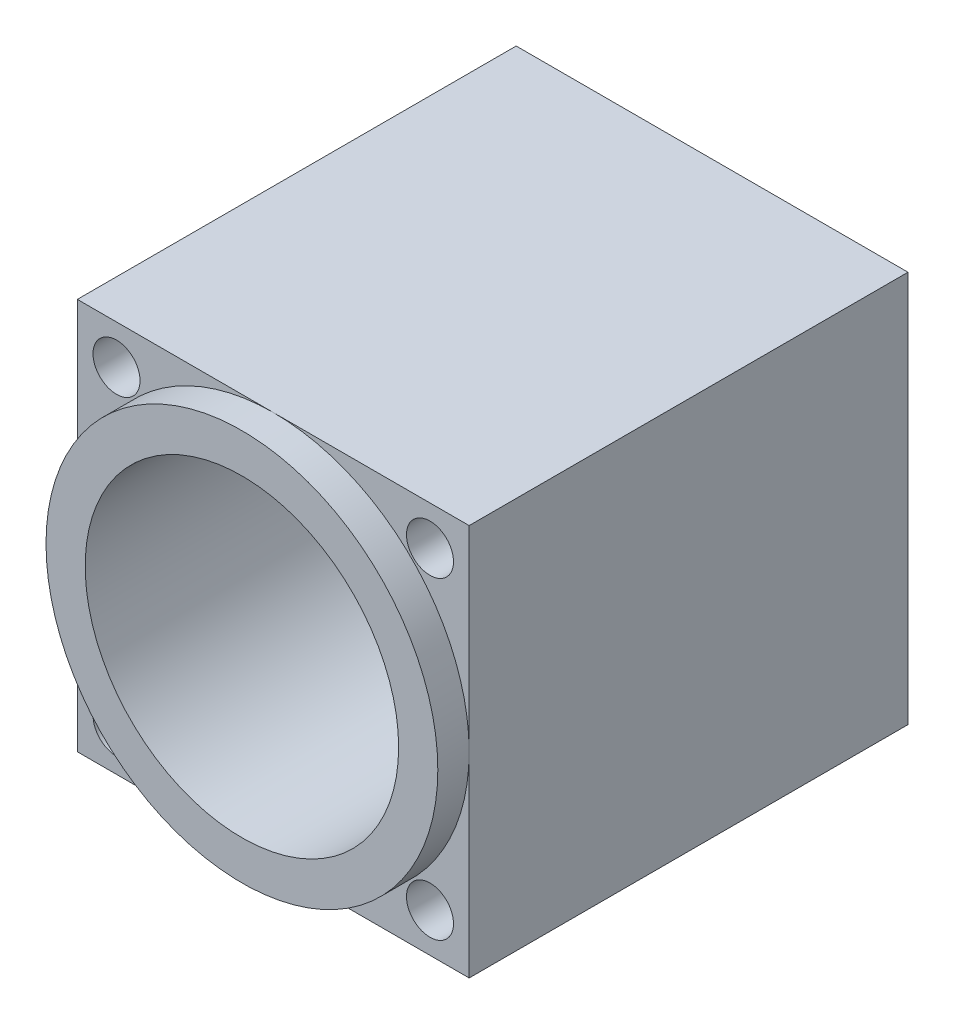
ISO-10303-21;
HEADER;
FILE_DESCRIPTION(('STEP AP214'),'2;1');
FILE_NAME('part.step','',(''),(''),'','','');
FILE_SCHEMA(('AUTOMOTIVE_DESIGN { 1 0 10303 214 1 1 1 1 }'));
ENDSEC;
DATA;
#1=APPLICATION_CONTEXT('core data for automotive mechanical design processes');
#2=APPLICATION_PROTOCOL_DEFINITION('international standard','automotive_design',2000,#1);
#3=PRODUCT_CONTEXT('',#1,'mechanical');
#4=PRODUCT('Part','Part','',(#3));
#5=PRODUCT_RELATED_PRODUCT_CATEGORY('part','',(#4));
#6=PRODUCT_DEFINITION_FORMATION('','',#4);
#7=PRODUCT_DEFINITION_CONTEXT('part definition',#1,'design');
#8=PRODUCT_DEFINITION('design','',#6,#7);
#9=PRODUCT_DEFINITION_SHAPE('','',#8);
#10=(LENGTH_UNIT() NAMED_UNIT(*) SI_UNIT(.MILLI.,.METRE.));
#11=(NAMED_UNIT(*) PLANE_ANGLE_UNIT() SI_UNIT($,.RADIAN.));
#12=(NAMED_UNIT(*) SI_UNIT($,.STERADIAN.) SOLID_ANGLE_UNIT());
#13=UNCERTAINTY_MEASURE_WITH_UNIT(LENGTH_MEASURE(1.E-05),#10,'distance_accuracy_value','');
#14=(GEOMETRIC_REPRESENTATION_CONTEXT(3) GLOBAL_UNCERTAINTY_ASSIGNED_CONTEXT((#13)) GLOBAL_UNIT_ASSIGNED_CONTEXT((#10,
#11,#12)) REPRESENTATION_CONTEXT('',''));
#15=CARTESIAN_POINT('',(0.,0.,0.));
#16=DIRECTION('',(0.,0.,1.));
#17=DIRECTION('',(1.,0.,0.));
#18=AXIS2_PLACEMENT_3D('',#15,#16,#17);
#19=CARTESIAN_POINT('',(-12.5,12.5,30.));
#20=DIRECTION('',(0.,0.,-1.));
#21=DIRECTION('',(-1.,0.,0.));
#22=AXIS2_PLACEMENT_3D('',#19,#20,#21);
#23=PLANE('',#22);
#24=CARTESIAN_POINT('',(0.,0.,30.));
#25=DIRECTION('',(0.,0.,1.));
#26=DIRECTION('',(1.,0.,0.));
#27=AXIS2_PLACEMENT_3D('',#24,#25,#26);
#28=CIRCLE('',#27,10.);
#29=CARTESIAN_POINT('',(10.,0.,30.));
#30=VERTEX_POINT('',#29);
#31=EDGE_CURVE('E129',#30,#30,#28,.T.);
#32=ORIENTED_EDGE('',*,*,#31,.F.);
#33=EDGE_LOOP('',(#32));
#34=FACE_BOUND('',#33,.T.);
#35=CARTESIAN_POINT('',(0.,0.,30.));
#36=DIRECTION('',(0.,0.,1.));
#37=DIRECTION('',(1.,0.,0.));
#38=AXIS2_PLACEMENT_3D('',#35,#36,#37);
#39=CIRCLE('',#38,12.5);
#40=CARTESIAN_POINT('',(12.5,0.,30.));
#41=VERTEX_POINT('',#40);
#42=EDGE_CURVE('E103',#41,#41,#39,.T.);
#43=ORIENTED_EDGE('',*,*,#42,.T.);
#44=EDGE_LOOP('',(#43));
#45=FACE_BOUND('',#44,.T.);
#46=ADVANCED_FACE('F31',(#34,#45),#23,.F.);
#47=CARTESIAN_POINT('',(-12.5,-12.5,30.));
#48=DIRECTION('',(1.,0.,0.));
#49=DIRECTION('',(0.,0.,-1.));
#50=AXIS2_PLACEMENT_3D('',#47,#48,#49);
#51=PLANE('',#50);
#52=DIRECTION('',(0.,-1.,0.));
#53=VECTOR('',#52,1.);
#54=CARTESIAN_POINT('',(-12.5,-12.5,28.));
#55=LINE('',#54,#53);
#56=CARTESIAN_POINT('',(-12.5,12.5,28.));
#57=VERTEX_POINT('',#56);
#58=CARTESIAN_POINT('',(-12.5,0.,28.));
#59=VERTEX_POINT('',#58);
#60=EDGE_CURVE('E124',#57,#59,#55,.T.);
#61=ORIENTED_EDGE('',*,*,#60,.F.);
#62=DIRECTION('',(0.,0.,-1.));
#63=VECTOR('',#62,1.);
#64=CARTESIAN_POINT('',(-12.5,12.5,30.));
#65=LINE('',#64,#63);
#66=CARTESIAN_POINT('',(-12.5,12.5,0.));
#67=VERTEX_POINT('',#66);
#68=EDGE_CURVE('E56',#57,#67,#65,.T.);
#69=ORIENTED_EDGE('',*,*,#68,.T.);
#70=DIRECTION('',(0.,-1.,0.));
#71=VECTOR('',#70,1.);
#72=CARTESIAN_POINT('',(-12.5,-12.5,0.));
#73=LINE('',#72,#71);
#74=CARTESIAN_POINT('',(-12.5,-12.5,0.));
#75=VERTEX_POINT('',#74);
#76=EDGE_CURVE('E147',#67,#75,#73,.T.);
#77=ORIENTED_EDGE('',*,*,#76,.T.);
#78=DIRECTION('',(0.,0.,-1.));
#79=VECTOR('',#78,1.);
#80=CARTESIAN_POINT('',(-12.5,-12.5,30.));
#81=LINE('',#80,#79);
#82=CARTESIAN_POINT('',(-12.5,-12.5,28.));
#83=VERTEX_POINT('',#82);
#84=EDGE_CURVE('E11',#83,#75,#81,.T.);
#85=ORIENTED_EDGE('',*,*,#84,.F.);
#86=EDGE_CURVE('E122',#59,#83,#55,.T.);
#87=ORIENTED_EDGE('',*,*,#86,.F.);
#88=EDGE_LOOP('',(#61,#69,#77,#85,#87));
#89=FACE_BOUND('',#88,.T.);
#90=ADVANCED_FACE('F33',(#89),#51,.F.);
#91=CARTESIAN_POINT('',(-12.5,-12.5,30.));
#92=DIRECTION('',(0.,1.,0.));
#93=DIRECTION('',(0.,0.,1.));
#94=AXIS2_PLACEMENT_3D('',#91,#92,#93);
#95=PLANE('',#94);
#96=DIRECTION('',(1.,0.,0.));
#97=VECTOR('',#96,1.);
#98=CARTESIAN_POINT('',(-12.5,-12.5,28.));
#99=LINE('',#98,#97);
#100=CARTESIAN_POINT('',(0.,-12.5,28.));
#101=VERTEX_POINT('',#100);
#102=EDGE_CURVE('E121',#83,#101,#99,.T.);
#103=ORIENTED_EDGE('',*,*,#102,.F.);
#104=ORIENTED_EDGE('',*,*,#84,.T.);
#105=DIRECTION('',(1.,0.,0.));
#106=VECTOR('',#105,1.);
#107=CARTESIAN_POINT('',(-12.5,-12.5,0.));
#108=LINE('',#107,#106);
#109=CARTESIAN_POINT('',(12.5,-12.5,0.));
#110=VERTEX_POINT('',#109);
#111=EDGE_CURVE('E149',#75,#110,#108,.T.);
#112=ORIENTED_EDGE('',*,*,#111,.T.);
#113=DIRECTION('',(0.,0.,-1.));
#114=VECTOR('',#113,1.);
#115=CARTESIAN_POINT('',(12.5,-12.5,30.));
#116=LINE('',#115,#114);
#117=CARTESIAN_POINT('',(12.5,-12.5,28.));
#118=VERTEX_POINT('',#117);
#119=EDGE_CURVE('E40',#118,#110,#116,.T.);
#120=ORIENTED_EDGE('',*,*,#119,.F.);
#121=EDGE_CURVE('E94',#101,#118,#99,.T.);
#122=ORIENTED_EDGE('',*,*,#121,.F.);
#123=EDGE_LOOP('',(#103,#104,#112,#120,#122));
#124=FACE_BOUND('',#123,.T.);
#125=ADVANCED_FACE('F207',(#124),#95,.F.);
#126=CARTESIAN_POINT('',(12.5,-12.5,30.));
#127=DIRECTION('',(-1.,0.,0.));
#128=DIRECTION('',(0.,0.,1.));
#129=AXIS2_PLACEMENT_3D('',#126,#127,#128);
#130=PLANE('',#129);
#131=DIRECTION('',(0.,1.,0.));
#132=VECTOR('',#131,1.);
#133=CARTESIAN_POINT('',(12.5,-12.5,28.));
#134=LINE('',#133,#132);
#135=CARTESIAN_POINT('',(12.5,0.,28.));
#136=VERTEX_POINT('',#135);
#137=EDGE_CURVE('E89',#118,#136,#134,.T.);
#138=ORIENTED_EDGE('',*,*,#137,.F.);
#139=ORIENTED_EDGE('',*,*,#119,.T.);
#140=DIRECTION('',(0.,1.,0.));
#141=VECTOR('',#140,1.);
#142=CARTESIAN_POINT('',(12.5,-12.5,0.));
#143=LINE('',#142,#141);
#144=CARTESIAN_POINT('',(12.5,12.5,0.));
#145=VERTEX_POINT('',#144);
#146=EDGE_CURVE('E152',#110,#145,#143,.T.);
#147=ORIENTED_EDGE('',*,*,#146,.T.);
#148=DIRECTION('',(0.,0.,-1.));
#149=VECTOR('',#148,1.);
#150=CARTESIAN_POINT('',(12.5,12.5,30.));
#151=LINE('',#150,#149);
#152=CARTESIAN_POINT('',(12.5,12.5,28.));
#153=VERTEX_POINT('',#152);
#154=EDGE_CURVE('E115',#153,#145,#151,.T.);
#155=ORIENTED_EDGE('',*,*,#154,.F.);
#156=EDGE_CURVE('E98',#136,#153,#134,.T.);
#157=ORIENTED_EDGE('',*,*,#156,.F.);
#158=EDGE_LOOP('',(#138,#139,#147,#155,#157));
#159=FACE_BOUND('',#158,.T.);
#160=ADVANCED_FACE('F113',(#159),#130,.F.);
#161=CARTESIAN_POINT('',(-12.5,12.5,30.));
#162=DIRECTION('',(0.,-1.,0.));
#163=DIRECTION('',(0.,0.,-1.));
#164=AXIS2_PLACEMENT_3D('',#161,#162,#163);
#165=PLANE('',#164);
#166=DIRECTION('',(-1.,0.,0.));
#167=VECTOR('',#166,1.);
#168=CARTESIAN_POINT('',(-12.5,12.5,28.));
#169=LINE('',#168,#167);
#170=CARTESIAN_POINT('',(0.,12.5,28.));
#171=VERTEX_POINT('',#170);
#172=EDGE_CURVE('E109',#153,#171,#169,.T.);
#173=ORIENTED_EDGE('',*,*,#172,.F.);
#174=ORIENTED_EDGE('',*,*,#154,.T.);
#175=DIRECTION('',(-1.,0.,0.));
#176=VECTOR('',#175,1.);
#177=CARTESIAN_POINT('',(-12.5,12.5,0.));
#178=LINE('',#177,#176);
#179=EDGE_CURVE('E154',#145,#67,#178,.T.);
#180=ORIENTED_EDGE('',*,*,#179,.T.);
#181=ORIENTED_EDGE('',*,*,#68,.F.);
#182=EDGE_CURVE('E116',#171,#57,#169,.T.);
#183=ORIENTED_EDGE('',*,*,#182,.F.);
#184=EDGE_LOOP('',(#173,#174,#180,#181,#183));
#185=FACE_BOUND('',#184,.T.);
#186=ADVANCED_FACE('F198',(#185),#165,.F.);
#187=CARTESIAN_POINT('',(10.,10.,30.));
#188=DIRECTION('',(0.,0.,-1.));
#189=DIRECTION('',(-1.,0.,0.));
#190=AXIS2_PLACEMENT_3D('',#187,#188,#189);
#191=CYLINDRICAL_SURFACE('',#190,1.5);
#192=CARTESIAN_POINT('',(10.,10.,0.));
#193=DIRECTION('',(0.,0.,1.));
#194=DIRECTION('',(1.,0.,0.));
#195=AXIS2_PLACEMENT_3D('',#192,#193,#194);
#196=CIRCLE('',#195,1.5);
#197=CARTESIAN_POINT('',(11.5,10.,0.));
#198=VERTEX_POINT('',#197);
#199=EDGE_CURVE('E141',#198,#198,#196,.T.);
#200=ORIENTED_EDGE('',*,*,#199,.F.);
#201=EDGE_LOOP('',(#200));
#202=FACE_BOUND('',#201,.T.);
#203=CARTESIAN_POINT('',(10.,10.,28.));
#204=DIRECTION('',(0.,0.,1.));
#205=DIRECTION('',(1.,0.,0.));
#206=AXIS2_PLACEMENT_3D('',#203,#204,#205);
#207=CIRCLE('',#206,1.5);
#208=CARTESIAN_POINT('',(11.5,10.,28.));
#209=VERTEX_POINT('',#208);
#210=EDGE_CURVE('E189',#209,#209,#207,.T.);
#211=ORIENTED_EDGE('',*,*,#210,.T.);
#212=EDGE_LOOP('',(#211));
#213=FACE_BOUND('',#212,.T.);
#214=ADVANCED_FACE('F233',(#202,#213),#191,.F.);
#215=CARTESIAN_POINT('',(-10.,10.,30.));
#216=DIRECTION('',(0.,0.,-1.));
#217=DIRECTION('',(-1.,0.,0.));
#218=AXIS2_PLACEMENT_3D('',#215,#216,#217);
#219=CYLINDRICAL_SURFACE('',#218,1.5);
#220=CARTESIAN_POINT('',(-10.,10.,0.));
#221=DIRECTION('',(0.,0.,1.));
#222=DIRECTION('',(-1.,0.,0.));
#223=AXIS2_PLACEMENT_3D('',#220,#221,#222);
#224=CIRCLE('',#223,1.5);
#225=CARTESIAN_POINT('',(-11.5,10.,0.));
#226=VERTEX_POINT('',#225);
#227=EDGE_CURVE('E138',#226,#226,#224,.T.);
#228=ORIENTED_EDGE('',*,*,#227,.F.);
#229=EDGE_LOOP('',(#228));
#230=FACE_BOUND('',#229,.T.);
#231=CARTESIAN_POINT('',(-10.,10.,28.));
#232=DIRECTION('',(0.,0.,1.));
#233=DIRECTION('',(1.,0.,0.));
#234=AXIS2_PLACEMENT_3D('',#231,#232,#233);
#235=CIRCLE('',#234,1.5);
#236=CARTESIAN_POINT('',(-8.5,10.,28.));
#237=VERTEX_POINT('',#236);
#238=EDGE_CURVE('E187',#237,#237,#235,.T.);
#239=ORIENTED_EDGE('',*,*,#238,.T.);
#240=EDGE_LOOP('',(#239));
#241=FACE_BOUND('',#240,.T.);
#242=ADVANCED_FACE('F229',(#230,#241),#219,.F.);
#243=CARTESIAN_POINT('',(10.,-10.,30.));
#244=DIRECTION('',(0.,0.,-1.));
#245=DIRECTION('',(-1.,0.,0.));
#246=AXIS2_PLACEMENT_3D('',#243,#244,#245);
#247=CYLINDRICAL_SURFACE('',#246,1.5);
#248=CARTESIAN_POINT('',(10.,-10.,0.));
#249=DIRECTION('',(0.,0.,1.));
#250=DIRECTION('',(-1.,0.,0.));
#251=AXIS2_PLACEMENT_3D('',#248,#249,#250);
#252=CIRCLE('',#251,1.5);
#253=CARTESIAN_POINT('',(8.5,-10.,0.));
#254=VERTEX_POINT('',#253);
#255=EDGE_CURVE('E135',#254,#254,#252,.T.);
#256=ORIENTED_EDGE('',*,*,#255,.F.);
#257=EDGE_LOOP('',(#256));
#258=FACE_BOUND('',#257,.T.);
#259=CARTESIAN_POINT('',(10.,-10.,28.));
#260=DIRECTION('',(0.,0.,1.));
#261=DIRECTION('',(1.,0.,0.));
#262=AXIS2_PLACEMENT_3D('',#259,#260,#261);
#263=CIRCLE('',#262,1.5);
#264=CARTESIAN_POINT('',(11.5,-10.,28.));
#265=VERTEX_POINT('',#264);
#266=EDGE_CURVE('E184',#265,#265,#263,.T.);
#267=ORIENTED_EDGE('',*,*,#266,.T.);
#268=EDGE_LOOP('',(#267));
#269=FACE_BOUND('',#268,.T.);
#270=ADVANCED_FACE('F225',(#258,#269),#247,.F.);
#271=CARTESIAN_POINT('',(-10.,-10.,30.));
#272=DIRECTION('',(0.,0.,-1.));
#273=DIRECTION('',(-1.,0.,0.));
#274=AXIS2_PLACEMENT_3D('',#271,#272,#273);
#275=CYLINDRICAL_SURFACE('',#274,1.5);
#276=CARTESIAN_POINT('',(-10.,-10.,0.));
#277=DIRECTION('',(0.,0.,1.));
#278=DIRECTION('',(1.,0.,0.));
#279=AXIS2_PLACEMENT_3D('',#276,#277,#278);
#280=CIRCLE('',#279,1.5);
#281=CARTESIAN_POINT('',(-8.5,-10.,0.));
#282=VERTEX_POINT('',#281);
#283=EDGE_CURVE('E132',#282,#282,#280,.T.);
#284=ORIENTED_EDGE('',*,*,#283,.F.);
#285=EDGE_LOOP('',(#284));
#286=FACE_BOUND('',#285,.T.);
#287=CARTESIAN_POINT('',(-10.,-10.,28.));
#288=DIRECTION('',(0.,0.,1.));
#289=DIRECTION('',(1.,0.,0.));
#290=AXIS2_PLACEMENT_3D('',#287,#288,#289);
#291=CIRCLE('',#290,1.5);
#292=CARTESIAN_POINT('',(-8.5,-10.,28.));
#293=VERTEX_POINT('',#292);
#294=EDGE_CURVE('E35',#293,#293,#291,.T.);
#295=ORIENTED_EDGE('',*,*,#294,.T.);
#296=EDGE_LOOP('',(#295));
#297=FACE_BOUND('',#296,.T.);
#298=ADVANCED_FACE('F222',(#286,#297),#275,.F.);
#299=CARTESIAN_POINT('',(0.,0.,30.));
#300=DIRECTION('',(0.,0.,-1.));
#301=DIRECTION('',(-1.,0.,0.));
#302=AXIS2_PLACEMENT_3D('',#299,#300,#301);
#303=CYLINDRICAL_SURFACE('',#302,3.);
#304=CARTESIAN_POINT('',(0.,0.,0.));
#305=DIRECTION('',(0.,0.,1.));
#306=DIRECTION('',(1.,0.,0.));
#307=AXIS2_PLACEMENT_3D('',#304,#305,#306);
#308=CIRCLE('',#307,3.);
#309=CARTESIAN_POINT('',(3.,0.,0.));
#310=VERTEX_POINT('',#309);
#311=EDGE_CURVE('E144',#310,#310,#308,.T.);
#312=ORIENTED_EDGE('',*,*,#311,.F.);
#313=EDGE_LOOP('',(#312));
#314=FACE_BOUND('',#313,.T.);
#315=CARTESIAN_POINT('',(0.,0.,2.));
#316=DIRECTION('',(0.,0.,1.));
#317=DIRECTION('',(1.,0.,0.));
#318=AXIS2_PLACEMENT_3D('',#315,#316,#317);
#319=CIRCLE('',#318,3.);
#320=CARTESIAN_POINT('',(3.,0.,2.));
#321=VERTEX_POINT('',#320);
#322=EDGE_CURVE('E128',#321,#321,#319,.T.);
#323=ORIENTED_EDGE('',*,*,#322,.T.);
#324=EDGE_LOOP('',(#323));
#325=FACE_BOUND('',#324,.T.);
#326=ADVANCED_FACE('F161',(#314,#325),#303,.F.);
#327=CARTESIAN_POINT('',(-12.5,12.5,0.));
#328=DIRECTION('',(0.,0.,-1.));
#329=DIRECTION('',(-1.,0.,0.));
#330=AXIS2_PLACEMENT_3D('',#327,#328,#329);
#331=PLANE('',#330);
#332=ORIENTED_EDGE('',*,*,#255,.T.);
#333=EDGE_LOOP('',(#332));
#334=FACE_BOUND('',#333,.T.);
#335=ORIENTED_EDGE('',*,*,#199,.T.);
#336=EDGE_LOOP('',(#335));
#337=FACE_BOUND('',#336,.T.);
#338=ORIENTED_EDGE('',*,*,#76,.F.);
#339=ORIENTED_EDGE('',*,*,#179,.F.);
#340=ORIENTED_EDGE('',*,*,#146,.F.);
#341=ORIENTED_EDGE('',*,*,#111,.F.);
#342=EDGE_LOOP('',(#338,#339,#340,#341));
#343=FACE_BOUND('',#342,.T.);
#344=ORIENTED_EDGE('',*,*,#311,.T.);
#345=EDGE_LOOP('',(#344));
#346=FACE_BOUND('',#345,.T.);
#347=ORIENTED_EDGE('',*,*,#227,.T.);
#348=EDGE_LOOP('',(#347));
#349=FACE_BOUND('',#348,.T.);
#350=ORIENTED_EDGE('',*,*,#283,.T.);
#351=EDGE_LOOP('',(#350));
#352=FACE_BOUND('',#351,.T.);
#353=ADVANCED_FACE('F172',(#334,#337,#343,#346,#349,#352),#331,.T.);
#354=CARTESIAN_POINT('',(0.,0.,2.));
#355=DIRECTION('',(0.,0.,1.));
#356=DIRECTION('',(1.,0.,0.));
#357=AXIS2_PLACEMENT_3D('',#354,#355,#356);
#358=CYLINDRICAL_SURFACE('',#357,10.);
#359=CARTESIAN_POINT('',(0.,0.,2.));
#360=DIRECTION('',(0.,0.,1.));
#361=DIRECTION('',(1.,0.,0.));
#362=AXIS2_PLACEMENT_3D('',#359,#360,#361);
#363=CIRCLE('',#362,10.);
#364=CARTESIAN_POINT('',(10.,0.,2.));
#365=VERTEX_POINT('',#364);
#366=EDGE_CURVE('E125',#365,#365,#363,.T.);
#367=ORIENTED_EDGE('',*,*,#366,.F.);
#368=EDGE_LOOP('',(#367));
#369=FACE_BOUND('',#368,.T.);
#370=ORIENTED_EDGE('',*,*,#31,.T.);
#371=EDGE_LOOP('',(#370));
#372=FACE_BOUND('',#371,.T.);
#373=ADVANCED_FACE('F166',(#369,#372),#358,.F.);
#374=CARTESIAN_POINT('',(0.,0.,2.));
#375=DIRECTION('',(0.,0.,1.));
#376=DIRECTION('',(1.,0.,0.));
#377=AXIS2_PLACEMENT_3D('',#374,#375,#376);
#378=PLANE('',#377);
#379=ORIENTED_EDGE('',*,*,#322,.F.);
#380=EDGE_LOOP('',(#379));
#381=FACE_BOUND('',#380,.T.);
#382=ORIENTED_EDGE('',*,*,#366,.T.);
#383=EDGE_LOOP('',(#382));
#384=FACE_BOUND('',#383,.T.);
#385=ADVANCED_FACE('F163',(#381,#384),#378,.T.);
#386=CARTESIAN_POINT('',(0.,0.,28.));
#387=DIRECTION('',(0.,0.,1.));
#388=DIRECTION('',(1.,0.,0.));
#389=AXIS2_PLACEMENT_3D('',#386,#387,#388);
#390=CYLINDRICAL_SURFACE('',#389,12.5);
#391=ORIENTED_EDGE('',*,*,#42,.F.);
#392=EDGE_LOOP('',(#391));
#393=FACE_BOUND('',#392,.T.);
#394=CARTESIAN_POINT('',(0.,0.,28.));
#395=DIRECTION('',(0.,0.,1.));
#396=DIRECTION('',(1.,0.,0.));
#397=AXIS2_PLACEMENT_3D('',#394,#395,#396);
#398=CIRCLE('',#397,12.5);
#399=EDGE_CURVE('E111',#171,#59,#398,.T.);
#400=ORIENTED_EDGE('',*,*,#399,.T.);
#401=EDGE_CURVE('E102',#59,#101,#398,.T.);
#402=ORIENTED_EDGE('',*,*,#401,.T.);
#403=EDGE_CURVE('E91',#101,#136,#398,.T.);
#404=ORIENTED_EDGE('',*,*,#403,.T.);
#405=EDGE_CURVE('E48',#136,#171,#398,.T.);
#406=ORIENTED_EDGE('',*,*,#405,.T.);
#407=EDGE_LOOP('',(#400,#402,#404,#406));
#408=FACE_BOUND('',#407,.T.);
#409=ADVANCED_FACE('F100',(#393,#408),#390,.T.);
#410=CARTESIAN_POINT('',(0.,0.,28.));
#411=DIRECTION('',(0.,0.,1.));
#412=DIRECTION('',(1.,0.,0.));
#413=AXIS2_PLACEMENT_3D('',#410,#411,#412);
#414=PLANE('',#413);
#415=ORIENTED_EDGE('',*,*,#238,.F.);
#416=EDGE_LOOP('',(#415));
#417=FACE_BOUND('',#416,.T.);
#418=ORIENTED_EDGE('',*,*,#60,.T.);
#419=ORIENTED_EDGE('',*,*,#399,.F.);
#420=ORIENTED_EDGE('',*,*,#182,.T.);
#421=EDGE_LOOP('',(#418,#419,#420));
#422=FACE_BOUND('',#421,.T.);
#423=ADVANCED_FACE('F194',(#417,#422),#414,.T.);
#424=ORIENTED_EDGE('',*,*,#294,.F.);
#425=EDGE_LOOP('',(#424));
#426=FACE_BOUND('',#425,.T.);
#427=ORIENTED_EDGE('',*,*,#86,.T.);
#428=ORIENTED_EDGE('',*,*,#102,.T.);
#429=ORIENTED_EDGE('',*,*,#401,.F.);
#430=EDGE_LOOP('',(#427,#428,#429));
#431=FACE_BOUND('',#430,.T.);
#432=ADVANCED_FACE('F209',(#426,#431),#414,.T.);
#433=ORIENTED_EDGE('',*,*,#266,.F.);
#434=EDGE_LOOP('',(#433));
#435=FACE_BOUND('',#434,.T.);
#436=ORIENTED_EDGE('',*,*,#121,.T.);
#437=ORIENTED_EDGE('',*,*,#137,.T.);
#438=ORIENTED_EDGE('',*,*,#403,.F.);
#439=EDGE_LOOP('',(#436,#437,#438));
#440=FACE_BOUND('',#439,.T.);
#441=ADVANCED_FACE('F90',(#435,#440),#414,.T.);
#442=ORIENTED_EDGE('',*,*,#210,.F.);
#443=EDGE_LOOP('',(#442));
#444=FACE_BOUND('',#443,.T.);
#445=ORIENTED_EDGE('',*,*,#156,.T.);
#446=ORIENTED_EDGE('',*,*,#172,.T.);
#447=ORIENTED_EDGE('',*,*,#405,.F.);
#448=EDGE_LOOP('',(#445,#446,#447));
#449=FACE_BOUND('',#448,.T.);
#450=ADVANCED_FACE('F107',(#444,#449),#414,.T.);
#451=CLOSED_SHELL('',(#46,#90,#125,#160,#186,#214,#242,#270,#298,#326,#353,#373,#385,#409,#423,
#432,#441,#450));
#452=MANIFOLD_SOLID_BREP('B2',#451);
#453=ADVANCED_BREP_SHAPE_REPRESENTATION('',(#18,#452),#14);
#454=SHAPE_DEFINITION_REPRESENTATION(#9,#453);
ENDSEC;
END-ISO-10303-21;
